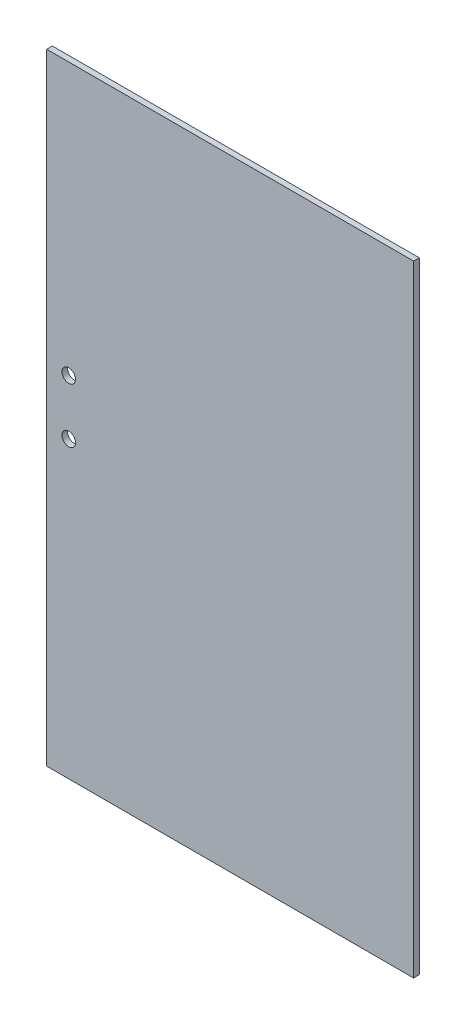
ISO-10303-21;
HEADER;
FILE_DESCRIPTION(('STEP AP214'),'2;1');
FILE_NAME('part.step','',(''),(''),'','','');
FILE_SCHEMA(('AUTOMOTIVE_DESIGN { 1 0 10303 214 1 1 1 1 }'));
ENDSEC;
DATA;
#1=APPLICATION_CONTEXT('core data for automotive mechanical design processes');
#2=APPLICATION_PROTOCOL_DEFINITION('international standard','automotive_design',2000,#1);
#3=PRODUCT_CONTEXT('',#1,'mechanical');
#4=PRODUCT('Part','Part','',(#3));
#5=PRODUCT_RELATED_PRODUCT_CATEGORY('part','',(#4));
#6=PRODUCT_DEFINITION_FORMATION('','',#4);
#7=PRODUCT_DEFINITION_CONTEXT('part definition',#1,'design');
#8=PRODUCT_DEFINITION('design','',#6,#7);
#9=PRODUCT_DEFINITION_SHAPE('','',#8);
#10=(LENGTH_UNIT() NAMED_UNIT(*) SI_UNIT(.MILLI.,.METRE.));
#11=(NAMED_UNIT(*) PLANE_ANGLE_UNIT() SI_UNIT($,.RADIAN.));
#12=(NAMED_UNIT(*) SI_UNIT($,.STERADIAN.) SOLID_ANGLE_UNIT());
#13=UNCERTAINTY_MEASURE_WITH_UNIT(LENGTH_MEASURE(1.E-05),#10,'distance_accuracy_value','');
#14=(GEOMETRIC_REPRESENTATION_CONTEXT(3) GLOBAL_UNCERTAINTY_ASSIGNED_CONTEXT((#13)) GLOBAL_UNIT_ASSIGNED_CONTEXT((#10,
#11,#12)) REPRESENTATION_CONTEXT('',''));
#15=CARTESIAN_POINT('',(0.,0.,0.));
#16=DIRECTION('',(0.,0.,1.));
#17=DIRECTION('',(1.,0.,0.));
#18=AXIS2_PLACEMENT_3D('',#15,#16,#17);
#19=CARTESIAN_POINT('',(162.5,275.,-5.));
#20=DIRECTION('',(1.,0.,0.));
#21=DIRECTION('',(0.,1.,0.));
#22=AXIS2_PLACEMENT_3D('',#19,#20,#21);
#23=PLANE('',#22);
#24=DIRECTION('',(0.,1.,0.));
#25=VECTOR('',#24,1.);
#26=CARTESIAN_POINT('',(162.5,275.,0.));
#27=LINE('',#26,#25);
#28=CARTESIAN_POINT('',(162.5,-275.,0.));
#29=VERTEX_POINT('',#28);
#30=CARTESIAN_POINT('',(162.5,275.,0.));
#31=VERTEX_POINT('',#30);
#32=EDGE_CURVE('E106',#29,#31,#27,.T.);
#33=ORIENTED_EDGE('',*,*,#32,.F.);
#34=DIRECTION('',(0.,0.,1.));
#35=VECTOR('',#34,1.);
#36=CARTESIAN_POINT('',(162.5,-275.,-5.));
#37=LINE('',#36,#35);
#38=CARTESIAN_POINT('',(162.5,-275.,-5.));
#39=VERTEX_POINT('',#38);
#40=EDGE_CURVE('E11',#39,#29,#37,.T.);
#41=ORIENTED_EDGE('',*,*,#40,.F.);
#42=DIRECTION('',(0.,1.,0.));
#43=VECTOR('',#42,1.);
#44=CARTESIAN_POINT('',(162.5,275.,-5.));
#45=LINE('',#44,#43);
#46=CARTESIAN_POINT('',(162.5,275.,-5.));
#47=VERTEX_POINT('',#46);
#48=EDGE_CURVE('E99',#39,#47,#45,.T.);
#49=ORIENTED_EDGE('',*,*,#48,.T.);
#50=DIRECTION('',(0.,0.,1.));
#51=VECTOR('',#50,1.);
#52=CARTESIAN_POINT('',(162.5,275.,-5.));
#53=LINE('',#52,#51);
#54=EDGE_CURVE('E44',#47,#31,#53,.T.);
#55=ORIENTED_EDGE('',*,*,#54,.T.);
#56=EDGE_LOOP('',(#33,#41,#49,#55));
#57=FACE_BOUND('',#56,.T.);
#58=ADVANCED_FACE('F41',(#57),#23,.T.);
#59=CARTESIAN_POINT('',(-162.5,-275.,-5.));
#60=DIRECTION('',(0.,-1.,0.));
#61=DIRECTION('',(0.,0.,-1.));
#62=AXIS2_PLACEMENT_3D('',#59,#60,#61);
#63=PLANE('',#62);
#64=DIRECTION('',(1.,0.,0.));
#65=VECTOR('',#64,1.);
#66=CARTESIAN_POINT('',(-162.5,-275.,0.));
#67=LINE('',#66,#65);
#68=CARTESIAN_POINT('',(-162.5,-275.,0.));
#69=VERTEX_POINT('',#68);
#70=EDGE_CURVE('E101',#69,#29,#67,.T.);
#71=ORIENTED_EDGE('',*,*,#70,.F.);
#72=DIRECTION('',(0.,0.,1.));
#73=VECTOR('',#72,1.);
#74=CARTESIAN_POINT('',(-162.5,-275.,-5.));
#75=LINE('',#74,#73);
#76=CARTESIAN_POINT('',(-162.5,-275.,-5.));
#77=VERTEX_POINT('',#76);
#78=EDGE_CURVE('E50',#77,#69,#75,.T.);
#79=ORIENTED_EDGE('',*,*,#78,.F.);
#80=DIRECTION('',(1.,0.,0.));
#81=VECTOR('',#80,1.);
#82=CARTESIAN_POINT('',(-162.5,-275.,-5.));
#83=LINE('',#82,#81);
#84=EDGE_CURVE('E96',#77,#39,#83,.T.);
#85=ORIENTED_EDGE('',*,*,#84,.T.);
#86=ORIENTED_EDGE('',*,*,#40,.T.);
#87=EDGE_LOOP('',(#71,#79,#85,#86));
#88=FACE_BOUND('',#87,.T.);
#89=ADVANCED_FACE('F117',(#88),#63,.T.);
#90=CARTESIAN_POINT('',(-162.5,275.,-5.));
#91=DIRECTION('',(-1.,0.,0.));
#92=DIRECTION('',(0.,-1.,0.));
#93=AXIS2_PLACEMENT_3D('',#90,#91,#92);
#94=PLANE('',#93);
#95=DIRECTION('',(0.,-1.,0.));
#96=VECTOR('',#95,1.);
#97=CARTESIAN_POINT('',(-162.5,275.,0.));
#98=LINE('',#97,#96);
#99=CARTESIAN_POINT('',(-162.5,275.,0.));
#100=VERTEX_POINT('',#99);
#101=EDGE_CURVE('E91',#100,#69,#98,.T.);
#102=ORIENTED_EDGE('',*,*,#101,.F.);
#103=DIRECTION('',(0.,0.,1.));
#104=VECTOR('',#103,1.);
#105=CARTESIAN_POINT('',(-162.5,275.,-5.));
#106=LINE('',#105,#104);
#107=CARTESIAN_POINT('',(-162.5,275.,-5.));
#108=VERTEX_POINT('',#107);
#109=EDGE_CURVE('E86',#108,#100,#106,.T.);
#110=ORIENTED_EDGE('',*,*,#109,.F.);
#111=DIRECTION('',(0.,-1.,0.));
#112=VECTOR('',#111,1.);
#113=CARTESIAN_POINT('',(-162.5,275.,-5.));
#114=LINE('',#113,#112);
#115=EDGE_CURVE('E89',#108,#77,#114,.T.);
#116=ORIENTED_EDGE('',*,*,#115,.T.);
#117=ORIENTED_EDGE('',*,*,#78,.T.);
#118=EDGE_LOOP('',(#102,#110,#116,#117));
#119=FACE_BOUND('',#118,.T.);
#120=ADVANCED_FACE('F88',(#119),#94,.T.);
#121=CARTESIAN_POINT('',(-162.5,275.,-5.));
#122=DIRECTION('',(0.,1.,0.));
#123=DIRECTION('',(0.,0.,1.));
#124=AXIS2_PLACEMENT_3D('',#121,#122,#123);
#125=PLANE('',#124);
#126=DIRECTION('',(-1.,0.,0.));
#127=VECTOR('',#126,1.);
#128=CARTESIAN_POINT('',(-162.5,275.,0.));
#129=LINE('',#128,#127);
#130=EDGE_CURVE('E109',#31,#100,#129,.T.);
#131=ORIENTED_EDGE('',*,*,#130,.F.);
#132=ORIENTED_EDGE('',*,*,#54,.F.);
#133=DIRECTION('',(-1.,0.,0.));
#134=VECTOR('',#133,1.);
#135=CARTESIAN_POINT('',(-162.5,275.,-5.));
#136=LINE('',#135,#134);
#137=EDGE_CURVE('E95',#47,#108,#136,.T.);
#138=ORIENTED_EDGE('',*,*,#137,.T.);
#139=ORIENTED_EDGE('',*,*,#109,.T.);
#140=EDGE_LOOP('',(#131,#132,#138,#139));
#141=FACE_BOUND('',#140,.T.);
#142=ADVANCED_FACE('F98',(#141),#125,.T.);
#143=CARTESIAN_POINT('',(0.,0.,-5.));
#144=DIRECTION('',(0.,0.,1.));
#145=DIRECTION('',(1.,0.,0.));
#146=AXIS2_PLACEMENT_3D('',#143,#144,#145);
#147=PLANE('',#146);
#148=CARTESIAN_POINT('',(-143.,34.4352255311546,-5.));
#149=DIRECTION('',(0.,0.,1.));
#150=DIRECTION('',(-1.,0.,0.));
#151=AXIS2_PLACEMENT_3D('',#148,#149,#150);
#152=CIRCLE('',#151,6.00000000000002);
#153=CARTESIAN_POINT('',(-149.,34.4352255311546,-5.));
#154=VERTEX_POINT('',#153);
#155=EDGE_CURVE('E150',#154,#154,#152,.T.);
#156=ORIENTED_EDGE('',*,*,#155,.T.);
#157=EDGE_LOOP('',(#156));
#158=FACE_BOUND('',#157,.T.);
#159=CARTESIAN_POINT('',(-143.,-14.2180363134171,-5.));
#160=DIRECTION('',(0.,0.,1.));
#161=DIRECTION('',(-1.,0.,0.));
#162=AXIS2_PLACEMENT_3D('',#159,#160,#161);
#163=CIRCLE('',#162,6.00000000000002);
#164=CARTESIAN_POINT('',(-149.,-14.2180363134171,-5.));
#165=VERTEX_POINT('',#164);
#166=EDGE_CURVE('E110',#165,#165,#163,.T.);
#167=ORIENTED_EDGE('',*,*,#166,.T.);
#168=EDGE_LOOP('',(#167));
#169=FACE_BOUND('',#168,.T.);
#170=ORIENTED_EDGE('',*,*,#48,.F.);
#171=ORIENTED_EDGE('',*,*,#84,.F.);
#172=ORIENTED_EDGE('',*,*,#115,.F.);
#173=ORIENTED_EDGE('',*,*,#137,.F.);
#174=EDGE_LOOP('',(#170,#171,#172,#173));
#175=FACE_BOUND('',#174,.T.);
#176=ADVANCED_FACE('F94',(#158,#169,#175),#147,.F.);
#177=CARTESIAN_POINT('',(0.,0.,0.));
#178=DIRECTION('',(0.,0.,1.));
#179=DIRECTION('',(1.,0.,0.));
#180=AXIS2_PLACEMENT_3D('',#177,#178,#179);
#181=PLANE('',#180);
#182=CARTESIAN_POINT('',(-143.,34.4352255311546,0.));
#183=DIRECTION('',(0.,0.,1.));
#184=DIRECTION('',(-1.,0.,0.));
#185=AXIS2_PLACEMENT_3D('',#182,#183,#184);
#186=CIRCLE('',#185,6.00000000000002);
#187=CARTESIAN_POINT('',(-149.,34.4352255311546,0.));
#188=VERTEX_POINT('',#187);
#189=EDGE_CURVE('E153',#188,#188,#186,.T.);
#190=ORIENTED_EDGE('',*,*,#189,.F.);
#191=EDGE_LOOP('',(#190));
#192=FACE_BOUND('',#191,.T.);
#193=CARTESIAN_POINT('',(-143.,-14.2180363134171,0.));
#194=DIRECTION('',(0.,0.,1.));
#195=DIRECTION('',(-1.,0.,0.));
#196=AXIS2_PLACEMENT_3D('',#193,#194,#195);
#197=CIRCLE('',#196,6.00000000000002);
#198=CARTESIAN_POINT('',(-149.,-14.2180363134171,0.));
#199=VERTEX_POINT('',#198);
#200=EDGE_CURVE('E155',#199,#199,#197,.T.);
#201=ORIENTED_EDGE('',*,*,#200,.F.);
#202=EDGE_LOOP('',(#201));
#203=FACE_BOUND('',#202,.T.);
#204=ORIENTED_EDGE('',*,*,#32,.T.);
#205=ORIENTED_EDGE('',*,*,#130,.T.);
#206=ORIENTED_EDGE('',*,*,#101,.T.);
#207=ORIENTED_EDGE('',*,*,#70,.T.);
#208=EDGE_LOOP('',(#204,#205,#206,#207));
#209=FACE_BOUND('',#208,.T.);
#210=ADVANCED_FACE('F116',(#192,#203,#209),#181,.T.);
#211=CARTESIAN_POINT('',(-143.,-14.2180363134171,-5.));
#212=DIRECTION('',(0.,0.,1.));
#213=DIRECTION('',(1.,0.,0.));
#214=AXIS2_PLACEMENT_3D('',#211,#212,#213);
#215=CYLINDRICAL_SURFACE('',#214,6.00000000000002);
#216=ORIENTED_EDGE('',*,*,#166,.F.);
#217=EDGE_LOOP('',(#216));
#218=FACE_BOUND('',#217,.T.);
#219=ORIENTED_EDGE('',*,*,#200,.T.);
#220=EDGE_LOOP('',(#219));
#221=FACE_BOUND('',#220,.T.);
#222=ADVANCED_FACE('F135',(#218,#221),#215,.F.);
#223=CARTESIAN_POINT('',(-143.,34.4352255311546,-5.));
#224=DIRECTION('',(0.,0.,1.));
#225=DIRECTION('',(1.,0.,0.));
#226=AXIS2_PLACEMENT_3D('',#223,#224,#225);
#227=CYLINDRICAL_SURFACE('',#226,6.00000000000002);
#228=ORIENTED_EDGE('',*,*,#155,.F.);
#229=EDGE_LOOP('',(#228));
#230=FACE_BOUND('',#229,.T.);
#231=ORIENTED_EDGE('',*,*,#189,.T.);
#232=EDGE_LOOP('',(#231));
#233=FACE_BOUND('',#232,.T.);
#234=ADVANCED_FACE('F142',(#230,#233),#227,.F.);
#235=CLOSED_SHELL('',(#58,#89,#120,#142,#176,#210,#222,#234));
#236=MANIFOLD_SOLID_BREP('B2',#235);
#237=ADVANCED_BREP_SHAPE_REPRESENTATION('',(#18,#236),#14);
#238=SHAPE_DEFINITION_REPRESENTATION(#9,#237);
ENDSEC;
END-ISO-10303-21;
